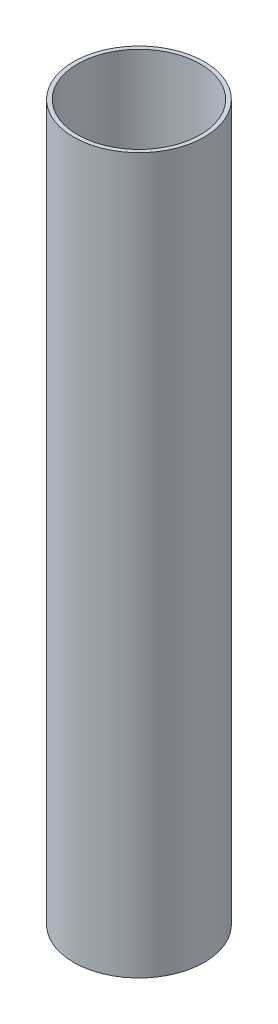
ISO-10303-21;
HEADER;
FILE_DESCRIPTION(('STEP AP214'),'2;1');
FILE_NAME('part.step','',(''),(''),'','','');
FILE_SCHEMA(('AUTOMOTIVE_DESIGN { 1 0 10303 214 1 1 1 1 }'));
ENDSEC;
DATA;
#1=APPLICATION_CONTEXT('core data for automotive mechanical design processes');
#2=APPLICATION_PROTOCOL_DEFINITION('international standard','automotive_design',2000,#1);
#3=PRODUCT_CONTEXT('',#1,'mechanical');
#4=PRODUCT('Part','Part','',(#3));
#5=PRODUCT_RELATED_PRODUCT_CATEGORY('part','',(#4));
#6=PRODUCT_DEFINITION_FORMATION('','',#4);
#7=PRODUCT_DEFINITION_CONTEXT('part definition',#1,'design');
#8=PRODUCT_DEFINITION('design','',#6,#7);
#9=PRODUCT_DEFINITION_SHAPE('','',#8);
#10=(LENGTH_UNIT() NAMED_UNIT(*) SI_UNIT(.MILLI.,.METRE.));
#11=(NAMED_UNIT(*) PLANE_ANGLE_UNIT() SI_UNIT($,.RADIAN.));
#12=(NAMED_UNIT(*) SI_UNIT($,.STERADIAN.) SOLID_ANGLE_UNIT());
#13=UNCERTAINTY_MEASURE_WITH_UNIT(LENGTH_MEASURE(1.E-05),#10,'distance_accuracy_value','');
#14=(GEOMETRIC_REPRESENTATION_CONTEXT(3) GLOBAL_UNCERTAINTY_ASSIGNED_CONTEXT((#13)) GLOBAL_UNIT_ASSIGNED_CONTEXT((#10,
#11,#12)) REPRESENTATION_CONTEXT('',''));
#15=CARTESIAN_POINT('',(0.,0.,0.));
#16=DIRECTION('',(0.,0.,1.));
#17=DIRECTION('',(1.,0.,0.));
#18=AXIS2_PLACEMENT_3D('',#15,#16,#17);
#19=CARTESIAN_POINT('',(0.,295.275,0.));
#20=DIRECTION('',(0.,1.,0.));
#21=DIRECTION('',(0.,0.,1.));
#22=AXIS2_PLACEMENT_3D('',#19,#20,#21);
#23=PLANE('',#22);
#24=CARTESIAN_POINT('',(0.,295.275,0.));
#25=DIRECTION('',(0.,1.,0.));
#26=DIRECTION('',(0.,0.,1.));
#27=AXIS2_PLACEMENT_3D('',#24,#25,#26);
#28=CIRCLE('',#27,27.);
#29=CARTESIAN_POINT('',(0.,295.275,27.));
#30=VERTEX_POINT('',#29);
#31=EDGE_CURVE('E10',#30,#30,#28,.T.);
#32=ORIENTED_EDGE('',*,*,#31,.T.);
#33=EDGE_LOOP('',(#32));
#34=FACE_BOUND('',#33,.T.);
#35=CARTESIAN_POINT('',(0.,295.275,0.));
#36=DIRECTION('',(0.,1.,0.));
#37=DIRECTION('',(0.,0.,1.));
#38=AXIS2_PLACEMENT_3D('',#35,#36,#37);
#39=CIRCLE('',#38,25.35);
#40=CARTESIAN_POINT('',(0.,295.275,25.35));
#41=VERTEX_POINT('',#40);
#42=EDGE_CURVE('E45',#41,#41,#39,.T.);
#43=ORIENTED_EDGE('',*,*,#42,.F.);
#44=EDGE_LOOP('',(#43));
#45=FACE_BOUND('',#44,.T.);
#46=ADVANCED_FACE('F34',(#34,#45),#23,.T.);
#47=CARTESIAN_POINT('',(0.,0.,0.));
#48=DIRECTION('',(0.,1.,0.));
#49=DIRECTION('',(0.,0.,1.));
#50=AXIS2_PLACEMENT_3D('',#47,#48,#49);
#51=PLANE('',#50);
#52=CARTESIAN_POINT('',(0.,0.,0.));
#53=DIRECTION('',(0.,1.,0.));
#54=DIRECTION('',(0.,0.,1.));
#55=AXIS2_PLACEMENT_3D('',#52,#53,#54);
#56=CIRCLE('',#55,27.);
#57=CARTESIAN_POINT('',(0.,0.,27.));
#58=VERTEX_POINT('',#57);
#59=EDGE_CURVE('E38',#58,#58,#56,.T.);
#60=ORIENTED_EDGE('',*,*,#59,.F.);
#61=EDGE_LOOP('',(#60));
#62=FACE_BOUND('',#61,.T.);
#63=CARTESIAN_POINT('',(0.,0.,0.));
#64=DIRECTION('',(0.,1.,0.));
#65=DIRECTION('',(0.,0.,1.));
#66=AXIS2_PLACEMENT_3D('',#63,#64,#65);
#67=CIRCLE('',#66,25.35);
#68=CARTESIAN_POINT('',(0.,0.,25.35));
#69=VERTEX_POINT('',#68);
#70=EDGE_CURVE('E47',#69,#69,#67,.T.);
#71=ORIENTED_EDGE('',*,*,#70,.T.);
#72=EDGE_LOOP('',(#71));
#73=FACE_BOUND('',#72,.T.);
#74=ADVANCED_FACE('F57',(#62,#73),#51,.F.);
#75=CARTESIAN_POINT('',(0.,295.275,0.));
#76=DIRECTION('',(0.,-1.,0.));
#77=DIRECTION('',(0.,0.,-1.));
#78=AXIS2_PLACEMENT_3D('',#75,#76,#77);
#79=CYLINDRICAL_SURFACE('',#78,27.);
#80=ORIENTED_EDGE('',*,*,#31,.F.);
#81=EDGE_LOOP('',(#80));
#82=FACE_BOUND('',#81,.T.);
#83=ORIENTED_EDGE('',*,*,#59,.T.);
#84=EDGE_LOOP('',(#83));
#85=FACE_BOUND('',#84,.T.);
#86=ADVANCED_FACE('F36',(#82,#85),#79,.T.);
#87=CARTESIAN_POINT('',(0.,295.275,0.));
#88=DIRECTION('',(0.,-1.,0.));
#89=DIRECTION('',(0.,0.,-1.));
#90=AXIS2_PLACEMENT_3D('',#87,#88,#89);
#91=CYLINDRICAL_SURFACE('',#90,25.35);
#92=ORIENTED_EDGE('',*,*,#42,.T.);
#93=EDGE_LOOP('',(#92));
#94=FACE_BOUND('',#93,.T.);
#95=ORIENTED_EDGE('',*,*,#70,.F.);
#96=EDGE_LOOP('',(#95));
#97=FACE_BOUND('',#96,.T.);
#98=ADVANCED_FACE('F53',(#94,#97),#91,.F.);
#99=CLOSED_SHELL('',(#46,#74,#86,#98));
#100=MANIFOLD_SOLID_BREP('B2',#99);
#101=ADVANCED_BREP_SHAPE_REPRESENTATION('',(#18,#100),#14);
#102=SHAPE_DEFINITION_REPRESENTATION(#9,#101);
ENDSEC;
END-ISO-10303-21;
